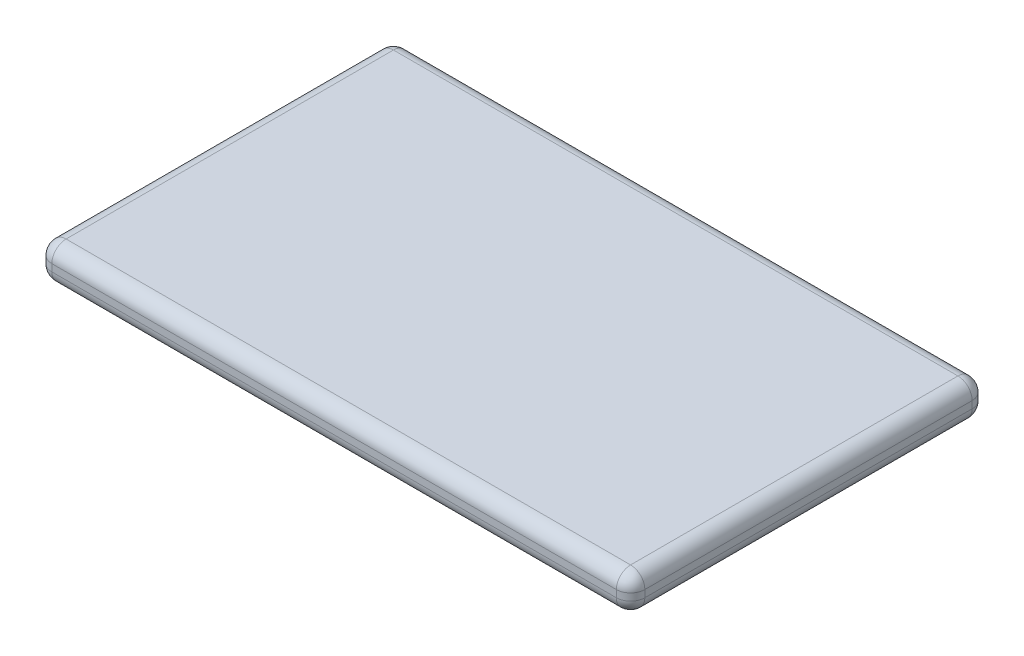
ISO-10303-21;
HEADER;
FILE_DESCRIPTION(('STEP AP214'),'2;1');
FILE_NAME('part.step','',(''),(''),'','','');
FILE_SCHEMA(('AUTOMOTIVE_DESIGN { 1 0 10303 214 1 1 1 1 }'));
ENDSEC;
DATA;
#1=APPLICATION_CONTEXT('core data for automotive mechanical design processes');
#2=APPLICATION_PROTOCOL_DEFINITION('international standard','automotive_design',2000,#1);
#3=PRODUCT_CONTEXT('',#1,'mechanical');
#4=PRODUCT('Part','Part','',(#3));
#5=PRODUCT_RELATED_PRODUCT_CATEGORY('part','',(#4));
#6=PRODUCT_DEFINITION_FORMATION('','',#4);
#7=PRODUCT_DEFINITION_CONTEXT('part definition',#1,'design');
#8=PRODUCT_DEFINITION('design','',#6,#7);
#9=PRODUCT_DEFINITION_SHAPE('','',#8);
#10=(LENGTH_UNIT() NAMED_UNIT(*) SI_UNIT(.MILLI.,.METRE.));
#11=(NAMED_UNIT(*) PLANE_ANGLE_UNIT() SI_UNIT($,.RADIAN.));
#12=(NAMED_UNIT(*) SI_UNIT($,.STERADIAN.) SOLID_ANGLE_UNIT());
#13=UNCERTAINTY_MEASURE_WITH_UNIT(LENGTH_MEASURE(1.E-05),#10,'distance_accuracy_value','');
#14=(GEOMETRIC_REPRESENTATION_CONTEXT(3) GLOBAL_UNCERTAINTY_ASSIGNED_CONTEXT((#13)) GLOBAL_UNIT_ASSIGNED_CONTEXT((#10,
#11,#12)) REPRESENTATION_CONTEXT('',''));
#15=CARTESIAN_POINT('',(0.,0.,0.));
#16=DIRECTION('',(0.,0.,1.));
#17=DIRECTION('',(1.,0.,0.));
#18=AXIS2_PLACEMENT_3D('',#15,#16,#17);
#19=CARTESIAN_POINT('',(-125.,15.,-75.));
#20=DIRECTION('',(0.,0.,-1.));
#21=DIRECTION('',(-1.,0.,0.));
#22=AXIS2_PLACEMENT_3D('',#19,#20,#21);
#23=PLANE('',#22);
#24=DIRECTION('',(1.,0.,0.));
#25=VECTOR('',#24,1.);
#26=CARTESIAN_POINT('',(-125.,6.,-75.));
#27=LINE('',#26,#25);
#28=CARTESIAN_POINT('',(119.,6.,-75.));
#29=VERTEX_POINT('',#28);
#30=CARTESIAN_POINT('',(-119.,6.,-75.));
#31=VERTEX_POINT('',#30);
#32=EDGE_CURVE('E217',#29,#31,#27,.F.);
#33=ORIENTED_EDGE('',*,*,#32,.T.);
#34=DIRECTION('',(0.,-1.,0.));
#35=VECTOR('',#34,1.);
#36=CARTESIAN_POINT('',(-119.,15.,-75.));
#37=LINE('',#36,#35);
#38=CARTESIAN_POINT('',(-119.,9.,-75.));
#39=VERTEX_POINT('',#38);
#40=EDGE_CURVE('E221',#31,#39,#37,.F.);
#41=ORIENTED_EDGE('',*,*,#40,.T.);
#42=DIRECTION('',(1.,0.,0.));
#43=VECTOR('',#42,1.);
#44=CARTESIAN_POINT('',(-125.,9.,-75.));
#45=LINE('',#44,#43);
#46=CARTESIAN_POINT('',(119.,9.,-75.));
#47=VERTEX_POINT('',#46);
#48=EDGE_CURVE('E214',#39,#47,#45,.T.);
#49=ORIENTED_EDGE('',*,*,#48,.T.);
#50=DIRECTION('',(0.,-1.,0.));
#51=VECTOR('',#50,1.);
#52=CARTESIAN_POINT('',(119.,0.,-75.));
#53=LINE('',#52,#51);
#54=EDGE_CURVE('E211',#47,#29,#53,.T.);
#55=ORIENTED_EDGE('',*,*,#54,.T.);
#56=EDGE_LOOP('',(#33,#41,#49,#55));
#57=FACE_BOUND('',#56,.T.);
#58=ADVANCED_FACE('F41',(#57),#23,.T.);
#59=CARTESIAN_POINT('',(-125.,15.,75.));
#60=DIRECTION('',(-1.,0.,0.));
#61=DIRECTION('',(0.,0.,1.));
#62=AXIS2_PLACEMENT_3D('',#59,#60,#61);
#63=PLANE('',#62);
#64=DIRECTION('',(0.,0.,-1.));
#65=VECTOR('',#64,1.);
#66=CARTESIAN_POINT('',(-125.,6.,75.));
#67=LINE('',#66,#65);
#68=CARTESIAN_POINT('',(-125.,6.,-69.));
#69=VERTEX_POINT('',#68);
#70=CARTESIAN_POINT('',(-125.,6.,69.));
#71=VERTEX_POINT('',#70);
#72=EDGE_CURVE('E137',#69,#71,#67,.F.);
#73=ORIENTED_EDGE('',*,*,#72,.T.);
#74=DIRECTION('',(0.,-1.,0.));
#75=VECTOR('',#74,1.);
#76=CARTESIAN_POINT('',(-125.,15.,69.));
#77=LINE('',#76,#75);
#78=CARTESIAN_POINT('',(-125.,9.,69.));
#79=VERTEX_POINT('',#78);
#80=EDGE_CURVE('E182',#71,#79,#77,.F.);
#81=ORIENTED_EDGE('',*,*,#80,.T.);
#82=DIRECTION('',(0.,0.,-1.));
#83=VECTOR('',#82,1.);
#84=CARTESIAN_POINT('',(-125.,9.,75.));
#85=LINE('',#84,#83);
#86=CARTESIAN_POINT('',(-125.,9.,-69.));
#87=VERTEX_POINT('',#86);
#88=EDGE_CURVE('E173',#79,#87,#85,.T.);
#89=ORIENTED_EDGE('',*,*,#88,.T.);
#90=DIRECTION('',(0.,-1.,0.));
#91=VECTOR('',#90,1.);
#92=CARTESIAN_POINT('',(-125.,15.,-69.));
#93=LINE('',#92,#91);
#94=EDGE_CURVE('E169',#87,#69,#93,.T.);
#95=ORIENTED_EDGE('',*,*,#94,.T.);
#96=EDGE_LOOP('',(#73,#81,#89,#95));
#97=FACE_BOUND('',#96,.T.);
#98=ADVANCED_FACE('F362',(#97),#63,.T.);
#99=CARTESIAN_POINT('',(-125.,15.,75.));
#100=DIRECTION('',(0.,0.,-1.));
#101=DIRECTION('',(-1.,0.,0.));
#102=AXIS2_PLACEMENT_3D('',#99,#100,#101);
#103=PLANE('',#102);
#104=DIRECTION('',(1.,0.,0.));
#105=VECTOR('',#104,1.);
#106=CARTESIAN_POINT('',(-125.,9.,75.));
#107=LINE('',#106,#105);
#108=CARTESIAN_POINT('',(119.,9.,75.));
#109=VERTEX_POINT('',#108);
#110=CARTESIAN_POINT('',(-119.,9.,75.));
#111=VERTEX_POINT('',#110);
#112=EDGE_CURVE('E188',#109,#111,#107,.F.);
#113=ORIENTED_EDGE('',*,*,#112,.T.);
#114=DIRECTION('',(0.,-1.,0.));
#115=VECTOR('',#114,1.);
#116=CARTESIAN_POINT('',(-119.,0.,75.));
#117=LINE('',#116,#115);
#118=CARTESIAN_POINT('',(-119.,6.,75.));
#119=VERTEX_POINT('',#118);
#120=EDGE_CURVE('E195',#111,#119,#117,.T.);
#121=ORIENTED_EDGE('',*,*,#120,.T.);
#122=DIRECTION('',(1.,0.,0.));
#123=VECTOR('',#122,1.);
#124=CARTESIAN_POINT('',(-125.,6.,75.));
#125=LINE('',#124,#123);
#126=CARTESIAN_POINT('',(119.,6.,75.));
#127=VERTEX_POINT('',#126);
#128=EDGE_CURVE('E191',#119,#127,#125,.T.);
#129=ORIENTED_EDGE('',*,*,#128,.T.);
#130=DIRECTION('',(0.,-1.,0.));
#131=VECTOR('',#130,1.);
#132=CARTESIAN_POINT('',(119.,15.,75.));
#133=LINE('',#132,#131);
#134=EDGE_CURVE('E185',#127,#109,#133,.F.);
#135=ORIENTED_EDGE('',*,*,#134,.T.);
#136=EDGE_LOOP('',(#113,#121,#129,#135));
#137=FACE_BOUND('',#136,.T.);
#138=ADVANCED_FACE('F325',(#137),#103,.F.);
#139=CARTESIAN_POINT('',(125.,15.,75.));
#140=DIRECTION('',(-1.,0.,0.));
#141=DIRECTION('',(0.,0.,1.));
#142=AXIS2_PLACEMENT_3D('',#139,#140,#141);
#143=PLANE('',#142);
#144=DIRECTION('',(0.,0.,-1.));
#145=VECTOR('',#144,1.);
#146=CARTESIAN_POINT('',(125.,9.,75.));
#147=LINE('',#146,#145);
#148=CARTESIAN_POINT('',(125.,9.,-69.));
#149=VERTEX_POINT('',#148);
#150=CARTESIAN_POINT('',(125.,9.,69.));
#151=VERTEX_POINT('',#150);
#152=EDGE_CURVE('E201',#149,#151,#147,.F.);
#153=ORIENTED_EDGE('',*,*,#152,.T.);
#154=DIRECTION('',(0.,-1.,0.));
#155=VECTOR('',#154,1.);
#156=CARTESIAN_POINT('',(125.,15.,69.));
#157=LINE('',#156,#155);
#158=CARTESIAN_POINT('',(125.,6.,69.));
#159=VERTEX_POINT('',#158);
#160=EDGE_CURVE('E208',#151,#159,#157,.T.);
#161=ORIENTED_EDGE('',*,*,#160,.T.);
#162=DIRECTION('',(0.,0.,-1.));
#163=VECTOR('',#162,1.);
#164=CARTESIAN_POINT('',(125.,6.,75.));
#165=LINE('',#164,#163);
#166=CARTESIAN_POINT('',(125.,6.,-69.));
#167=VERTEX_POINT('',#166);
#168=EDGE_CURVE('E204',#159,#167,#165,.T.);
#169=ORIENTED_EDGE('',*,*,#168,.T.);
#170=DIRECTION('',(0.,-1.,0.));
#171=VECTOR('',#170,1.);
#172=CARTESIAN_POINT('',(125.,15.,-69.));
#173=LINE('',#172,#171);
#174=EDGE_CURVE('E198',#167,#149,#173,.F.);
#175=ORIENTED_EDGE('',*,*,#174,.T.);
#176=EDGE_LOOP('',(#153,#161,#169,#175));
#177=FACE_BOUND('',#176,.T.);
#178=ADVANCED_FACE('F334',(#177),#143,.F.);
#179=CARTESIAN_POINT('',(0.,15.,0.));
#180=DIRECTION('',(0.,1.,0.));
#181=DIRECTION('',(0.,0.,1.));
#182=AXIS2_PLACEMENT_3D('',#179,#180,#181);
#183=PLANE('',#182);
#184=DIRECTION('',(1.,0.,0.));
#185=VECTOR('',#184,1.);
#186=CARTESIAN_POINT('',(125.,15.,69.));
#187=LINE('',#186,#185);
#188=CARTESIAN_POINT('',(-119.,15.,69.));
#189=VERTEX_POINT('',#188);
#190=CARTESIAN_POINT('',(119.,15.,69.));
#191=VERTEX_POINT('',#190);
#192=EDGE_CURVE('E51',#189,#191,#187,.T.);
#193=ORIENTED_EDGE('',*,*,#192,.T.);
#194=DIRECTION('',(0.,0.,-1.));
#195=VECTOR('',#194,1.);
#196=CARTESIAN_POINT('',(119.,15.,-75.));
#197=LINE('',#196,#195);
#198=CARTESIAN_POINT('',(119.,15.,-69.));
#199=VERTEX_POINT('',#198);
#200=EDGE_CURVE('E11',#191,#199,#197,.T.);
#201=ORIENTED_EDGE('',*,*,#200,.T.);
#202=DIRECTION('',(1.,0.,0.));
#203=VECTOR('',#202,1.);
#204=CARTESIAN_POINT('',(0.,15.,-69.));
#205=LINE('',#204,#203);
#206=CARTESIAN_POINT('',(-119.,15.,-69.));
#207=VERTEX_POINT('',#206);
#208=EDGE_CURVE('E224',#199,#207,#205,.F.);
#209=ORIENTED_EDGE('',*,*,#208,.T.);
#210=DIRECTION('',(0.,0.,-1.));
#211=VECTOR('',#210,1.);
#212=CARTESIAN_POINT('',(-119.,15.,0.));
#213=LINE('',#212,#211);
#214=EDGE_CURVE('E62',#207,#189,#213,.F.);
#215=ORIENTED_EDGE('',*,*,#214,.T.);
#216=EDGE_LOOP('',(#193,#201,#209,#215));
#217=FACE_BOUND('',#216,.T.);
#218=ADVANCED_FACE('F346',(#217),#183,.T.);
#219=CARTESIAN_POINT('',(0.,0.,0.));
#220=DIRECTION('',(0.,1.,0.));
#221=DIRECTION('',(0.,0.,1.));
#222=AXIS2_PLACEMENT_3D('',#219,#220,#221);
#223=PLANE('',#222);
#224=DIRECTION('',(1.,0.,0.));
#225=VECTOR('',#224,1.);
#226=CARTESIAN_POINT('',(0.,0.,69.));
#227=LINE('',#226,#225);
#228=CARTESIAN_POINT('',(119.,0.,69.));
#229=VERTEX_POINT('',#228);
#230=CARTESIAN_POINT('',(-119.,0.,69.));
#231=VERTEX_POINT('',#230);
#232=EDGE_CURVE('E166',#229,#231,#227,.F.);
#233=ORIENTED_EDGE('',*,*,#232,.T.);
#234=DIRECTION('',(0.,0.,-1.));
#235=VECTOR('',#234,1.);
#236=CARTESIAN_POINT('',(-119.,0.,-75.));
#237=LINE('',#236,#235);
#238=CARTESIAN_POINT('',(-119.,0.,-69.));
#239=VERTEX_POINT('',#238);
#240=EDGE_CURVE('E135',#231,#239,#237,.T.);
#241=ORIENTED_EDGE('',*,*,#240,.T.);
#242=DIRECTION('',(1.,0.,0.));
#243=VECTOR('',#242,1.);
#244=CARTESIAN_POINT('',(125.,0.,-69.));
#245=LINE('',#244,#243);
#246=CARTESIAN_POINT('',(119.,0.,-69.));
#247=VERTEX_POINT('',#246);
#248=EDGE_CURVE('E155',#239,#247,#245,.T.);
#249=ORIENTED_EDGE('',*,*,#248,.T.);
#250=DIRECTION('',(0.,0.,-1.));
#251=VECTOR('',#250,1.);
#252=CARTESIAN_POINT('',(119.,0.,0.));
#253=LINE('',#252,#251);
#254=EDGE_CURVE('E162',#247,#229,#253,.F.);
#255=ORIENTED_EDGE('',*,*,#254,.T.);
#256=EDGE_LOOP('',(#233,#241,#249,#255));
#257=FACE_BOUND('',#256,.T.);
#258=ADVANCED_FACE('F164',(#257),#223,.F.);
#259=CARTESIAN_POINT('',(119.,9.,0.));
#260=DIRECTION('',(0.,0.,1.));
#261=DIRECTION('',(1.,0.,0.));
#262=AXIS2_PLACEMENT_3D('',#259,#260,#261);
#263=CYLINDRICAL_SURFACE('',#262,6.);
#264=CARTESIAN_POINT('',(119.,9.,69.));
#265=DIRECTION('',(0.,0.,1.));
#266=DIRECTION('',(1.,0.,0.));
#267=AXIS2_PLACEMENT_3D('',#264,#265,#266);
#268=CIRCLE('',#267,6.);
#269=EDGE_CURVE('E45',#151,#191,#268,.T.);
#270=ORIENTED_EDGE('',*,*,#269,.F.);
#271=ORIENTED_EDGE('',*,*,#152,.F.);
#272=CARTESIAN_POINT('',(119.,9.,-69.));
#273=DIRECTION('',(0.,0.,-1.));
#274=DIRECTION('',(-1.,0.,0.));
#275=AXIS2_PLACEMENT_3D('',#272,#273,#274);
#276=CIRCLE('',#275,6.);
#277=EDGE_CURVE('E301',#199,#149,#276,.T.);
#278=ORIENTED_EDGE('',*,*,#277,.F.);
#279=ORIENTED_EDGE('',*,*,#200,.F.);
#280=EDGE_LOOP('',(#270,#271,#278,#279));
#281=FACE_BOUND('',#280,.T.);
#282=ADVANCED_FACE('F43',(#281),#263,.T.);
#283=CARTESIAN_POINT('',(119.,9.,69.));
#284=DIRECTION('',(0.,1.,0.));
#285=DIRECTION('',(0.,0.,1.));
#286=AXIS2_PLACEMENT_3D('',#283,#284,#285);
#287=SPHERICAL_SURFACE('',#286,6.);
#288=CARTESIAN_POINT('',(119.,9.,69.));
#289=DIRECTION('',(0.,1.,0.));
#290=DIRECTION('',(0.,0.,1.));
#291=AXIS2_PLACEMENT_3D('',#288,#289,#290);
#292=CIRCLE('',#291,6.);
#293=EDGE_CURVE('E294',#151,#109,#292,.F.);
#294=ORIENTED_EDGE('',*,*,#293,.F.);
#295=ORIENTED_EDGE('',*,*,#269,.T.);
#296=CARTESIAN_POINT('',(119.,9.,69.));
#297=DIRECTION('',(1.,0.,0.));
#298=DIRECTION('',(0.,0.,-1.));
#299=AXIS2_PLACEMENT_3D('',#296,#297,#298);
#300=CIRCLE('',#299,6.);
#301=EDGE_CURVE('E298',#109,#191,#300,.F.);
#302=ORIENTED_EDGE('',*,*,#301,.F.);
#303=EDGE_LOOP('',(#294,#295,#302));
#304=FACE_BOUND('',#303,.T.);
#305=ADVANCED_FACE('F314',(#304),#287,.T.);
#306=CARTESIAN_POINT('',(119.,9.,-69.));
#307=DIRECTION('',(1.,0.,0.));
#308=DIRECTION('',(0.,0.,-1.));
#309=AXIS2_PLACEMENT_3D('',#306,#307,#308);
#310=SPHERICAL_SURFACE('',#309,6.);
#311=CARTESIAN_POINT('',(119.,9.,-69.));
#312=DIRECTION('',(1.,0.,0.));
#313=DIRECTION('',(0.,0.,-1.));
#314=AXIS2_PLACEMENT_3D('',#311,#312,#313);
#315=CIRCLE('',#314,6.);
#316=EDGE_CURVE('E286',#199,#47,#315,.F.);
#317=ORIENTED_EDGE('',*,*,#316,.F.);
#318=ORIENTED_EDGE('',*,*,#277,.T.);
#319=CARTESIAN_POINT('',(119.,9.,-69.));
#320=DIRECTION('',(0.,1.,0.));
#321=DIRECTION('',(0.,0.,1.));
#322=AXIS2_PLACEMENT_3D('',#319,#320,#321);
#323=CIRCLE('',#322,6.);
#324=EDGE_CURVE('E290',#47,#149,#323,.F.);
#325=ORIENTED_EDGE('',*,*,#324,.F.);
#326=EDGE_LOOP('',(#317,#318,#325));
#327=FACE_BOUND('',#326,.T.);
#328=ADVANCED_FACE('F514',(#327),#310,.T.);
#329=CARTESIAN_POINT('',(0.,9.,69.));
#330=DIRECTION('',(-1.,0.,0.));
#331=DIRECTION('',(0.,0.,1.));
#332=AXIS2_PLACEMENT_3D('',#329,#330,#331);
#333=CYLINDRICAL_SURFACE('',#332,6.);
#334=ORIENTED_EDGE('',*,*,#301,.T.);
#335=ORIENTED_EDGE('',*,*,#192,.F.);
#336=CARTESIAN_POINT('',(-119.,9.,69.));
#337=DIRECTION('',(-1.,0.,0.));
#338=DIRECTION('',(0.,0.,1.));
#339=AXIS2_PLACEMENT_3D('',#336,#337,#338);
#340=CIRCLE('',#339,6.);
#341=EDGE_CURVE('E278',#111,#189,#340,.T.);
#342=ORIENTED_EDGE('',*,*,#341,.F.);
#343=ORIENTED_EDGE('',*,*,#112,.F.);
#344=EDGE_LOOP('',(#334,#335,#342,#343));
#345=FACE_BOUND('',#344,.T.);
#346=ADVANCED_FACE('F320',(#345),#333,.T.);
#347=CARTESIAN_POINT('',(119.,15.,69.));
#348=DIRECTION('',(0.,-1.,0.));
#349=DIRECTION('',(0.,0.,-1.));
#350=AXIS2_PLACEMENT_3D('',#347,#348,#349);
#351=CYLINDRICAL_SURFACE('',#350,6.);
#352=ORIENTED_EDGE('',*,*,#293,.T.);
#353=ORIENTED_EDGE('',*,*,#134,.F.);
#354=CARTESIAN_POINT('',(119.,6.,69.));
#355=DIRECTION('',(0.,-1.,0.));
#356=DIRECTION('',(0.,0.,-1.));
#357=AXIS2_PLACEMENT_3D('',#354,#355,#356);
#358=CIRCLE('',#357,6.);
#359=EDGE_CURVE('E274',#159,#127,#358,.T.);
#360=ORIENTED_EDGE('',*,*,#359,.F.);
#361=ORIENTED_EDGE('',*,*,#160,.F.);
#362=EDGE_LOOP('',(#352,#353,#360,#361));
#363=FACE_BOUND('',#362,.T.);
#364=ADVANCED_FACE('F331',(#363),#351,.T.);
#365=CARTESIAN_POINT('',(119.,6.,75.));
#366=DIRECTION('',(0.,0.,-1.));
#367=DIRECTION('',(-1.,0.,0.));
#368=AXIS2_PLACEMENT_3D('',#365,#366,#367);
#369=CYLINDRICAL_SURFACE('',#368,6.);
#370=CARTESIAN_POINT('',(119.,6.,-69.));
#371=DIRECTION('',(0.,0.,-1.));
#372=DIRECTION('',(-1.,0.,0.));
#373=AXIS2_PLACEMENT_3D('',#370,#371,#372);
#374=CIRCLE('',#373,6.);
#375=EDGE_CURVE('E266',#167,#247,#374,.T.);
#376=ORIENTED_EDGE('',*,*,#375,.F.);
#377=ORIENTED_EDGE('',*,*,#168,.F.);
#378=CARTESIAN_POINT('',(119.,6.,69.));
#379=DIRECTION('',(0.,0.,1.));
#380=DIRECTION('',(1.,0.,0.));
#381=AXIS2_PLACEMENT_3D('',#378,#379,#380);
#382=CIRCLE('',#381,6.);
#383=EDGE_CURVE('E270',#229,#159,#382,.T.);
#384=ORIENTED_EDGE('',*,*,#383,.F.);
#385=ORIENTED_EDGE('',*,*,#254,.F.);
#386=EDGE_LOOP('',(#376,#377,#384,#385));
#387=FACE_BOUND('',#386,.T.);
#388=ADVANCED_FACE('F338',(#387),#369,.T.);
#389=CARTESIAN_POINT('',(119.,15.,-69.));
#390=DIRECTION('',(0.,1.,0.));
#391=DIRECTION('',(0.,0.,1.));
#392=AXIS2_PLACEMENT_3D('',#389,#390,#391);
#393=CYLINDRICAL_SURFACE('',#392,6.);
#394=ORIENTED_EDGE('',*,*,#324,.T.);
#395=ORIENTED_EDGE('',*,*,#174,.F.);
#396=CARTESIAN_POINT('',(119.,6.,-69.));
#397=DIRECTION('',(0.,-1.,0.));
#398=DIRECTION('',(0.,0.,-1.));
#399=AXIS2_PLACEMENT_3D('',#396,#397,#398);
#400=CIRCLE('',#399,6.);
#401=EDGE_CURVE('E263',#29,#167,#400,.T.);
#402=ORIENTED_EDGE('',*,*,#401,.F.);
#403=ORIENTED_EDGE('',*,*,#54,.F.);
#404=EDGE_LOOP('',(#394,#395,#402,#403));
#405=FACE_BOUND('',#404,.T.);
#406=ADVANCED_FACE('F344',(#405),#393,.T.);
#407=CARTESIAN_POINT('',(-125.,9.,-69.));
#408=DIRECTION('',(1.,0.,0.));
#409=DIRECTION('',(0.,0.,-1.));
#410=AXIS2_PLACEMENT_3D('',#407,#408,#409);
#411=CYLINDRICAL_SURFACE('',#410,6.);
#412=ORIENTED_EDGE('',*,*,#316,.T.);
#413=ORIENTED_EDGE('',*,*,#48,.F.);
#414=CARTESIAN_POINT('',(-119.,9.,-69.));
#415=DIRECTION('',(-1.,0.,0.));
#416=DIRECTION('',(0.,0.,1.));
#417=AXIS2_PLACEMENT_3D('',#414,#415,#416);
#418=CIRCLE('',#417,6.);
#419=EDGE_CURVE('E259',#207,#39,#418,.T.);
#420=ORIENTED_EDGE('',*,*,#419,.F.);
#421=ORIENTED_EDGE('',*,*,#208,.F.);
#422=EDGE_LOOP('',(#412,#413,#420,#421));
#423=FACE_BOUND('',#422,.T.);
#424=ADVANCED_FACE('F355',(#423),#411,.T.);
#425=CARTESIAN_POINT('',(-119.,9.,75.));
#426=DIRECTION('',(0.,0.,-1.));
#427=DIRECTION('',(-1.,0.,0.));
#428=AXIS2_PLACEMENT_3D('',#425,#426,#427);
#429=CYLINDRICAL_SURFACE('',#428,6.);
#430=CARTESIAN_POINT('',(-119.,9.,69.));
#431=DIRECTION('',(0.,0.,1.));
#432=DIRECTION('',(1.,0.,0.));
#433=AXIS2_PLACEMENT_3D('',#430,#431,#432);
#434=CIRCLE('',#433,6.);
#435=EDGE_CURVE('E282',#189,#79,#434,.T.);
#436=ORIENTED_EDGE('',*,*,#435,.F.);
#437=ORIENTED_EDGE('',*,*,#214,.F.);
#438=CARTESIAN_POINT('',(-119.,9.,-69.));
#439=DIRECTION('',(0.,0.,-1.));
#440=DIRECTION('',(0.,1.,0.));
#441=AXIS2_PLACEMENT_3D('',#438,#439,#440);
#442=CIRCLE('',#441,6.);
#443=EDGE_CURVE('E255',#87,#207,#442,.T.);
#444=ORIENTED_EDGE('',*,*,#443,.F.);
#445=ORIENTED_EDGE('',*,*,#88,.F.);
#446=EDGE_LOOP('',(#436,#437,#444,#445));
#447=FACE_BOUND('',#446,.T.);
#448=ADVANCED_FACE('F351',(#447),#429,.T.);
#449=CARTESIAN_POINT('',(-119.,9.,69.));
#450=DIRECTION('',(0.,1.,0.));
#451=DIRECTION('',(0.,0.,1.));
#452=AXIS2_PLACEMENT_3D('',#449,#450,#451);
#453=SPHERICAL_SURFACE('',#452,6.);
#454=ORIENTED_EDGE('',*,*,#341,.T.);
#455=ORIENTED_EDGE('',*,*,#435,.T.);
#456=CARTESIAN_POINT('',(-119.,9.,69.));
#457=DIRECTION('',(0.,1.,0.));
#458=DIRECTION('',(0.,0.,1.));
#459=AXIS2_PLACEMENT_3D('',#456,#457,#458);
#460=CIRCLE('',#459,6.);
#461=EDGE_CURVE('E251',#111,#79,#460,.F.);
#462=ORIENTED_EDGE('',*,*,#461,.F.);
#463=EDGE_LOOP('',(#454,#455,#462));
#464=FACE_BOUND('',#463,.T.);
#465=ADVANCED_FACE('F365',(#464),#453,.T.);
#466=CARTESIAN_POINT('',(119.,6.,69.));
#467=DIRECTION('',(1.,0.,0.));
#468=DIRECTION('',(0.,0.,-1.));
#469=AXIS2_PLACEMENT_3D('',#466,#467,#468);
#470=SPHERICAL_SURFACE('',#469,6.);
#471=ORIENTED_EDGE('',*,*,#383,.T.);
#472=ORIENTED_EDGE('',*,*,#359,.T.);
#473=CARTESIAN_POINT('',(119.,6.,69.));
#474=DIRECTION('',(1.,0.,0.));
#475=DIRECTION('',(0.,0.,-1.));
#476=AXIS2_PLACEMENT_3D('',#473,#474,#475);
#477=CIRCLE('',#476,6.);
#478=EDGE_CURVE('E248',#229,#127,#477,.F.);
#479=ORIENTED_EDGE('',*,*,#478,.F.);
#480=EDGE_LOOP('',(#471,#472,#479));
#481=FACE_BOUND('',#480,.T.);
#482=ADVANCED_FACE('F375',(#481),#470,.T.);
#483=CARTESIAN_POINT('',(119.,6.,-69.));
#484=DIRECTION('',(1.,0.,0.));
#485=DIRECTION('',(0.,0.,-1.));
#486=AXIS2_PLACEMENT_3D('',#483,#484,#485);
#487=SPHERICAL_SURFACE('',#486,6.);
#488=ORIENTED_EDGE('',*,*,#401,.T.);
#489=ORIENTED_EDGE('',*,*,#375,.T.);
#490=CARTESIAN_POINT('',(119.,6.,-69.));
#491=DIRECTION('',(1.,0.,0.));
#492=DIRECTION('',(0.,0.,-1.));
#493=AXIS2_PLACEMENT_3D('',#490,#491,#492);
#494=CIRCLE('',#493,6.);
#495=EDGE_CURVE('E158',#29,#247,#494,.F.);
#496=ORIENTED_EDGE('',*,*,#495,.F.);
#497=EDGE_LOOP('',(#488,#489,#496));
#498=FACE_BOUND('',#497,.T.);
#499=ADVANCED_FACE('F377',(#498),#487,.T.);
#500=CARTESIAN_POINT('',(-119.,9.,-69.));
#501=DIRECTION('',(0.,1.,0.));
#502=DIRECTION('',(0.,0.,1.));
#503=AXIS2_PLACEMENT_3D('',#500,#501,#502);
#504=SPHERICAL_SURFACE('',#503,6.);
#505=ORIENTED_EDGE('',*,*,#443,.T.);
#506=ORIENTED_EDGE('',*,*,#419,.T.);
#507=CARTESIAN_POINT('',(-119.,9.,-69.));
#508=DIRECTION('',(0.,1.,0.));
#509=DIRECTION('',(0.,0.,1.));
#510=AXIS2_PLACEMENT_3D('',#507,#508,#509);
#511=CIRCLE('',#510,6.);
#512=EDGE_CURVE('E242',#87,#39,#511,.F.);
#513=ORIENTED_EDGE('',*,*,#512,.F.);
#514=EDGE_LOOP('',(#505,#506,#513));
#515=FACE_BOUND('',#514,.T.);
#516=ADVANCED_FACE('F357',(#515),#504,.T.);
#517=CARTESIAN_POINT('',(-119.,15.,69.));
#518=DIRECTION('',(0.,1.,0.));
#519=DIRECTION('',(0.,0.,1.));
#520=AXIS2_PLACEMENT_3D('',#517,#518,#519);
#521=CYLINDRICAL_SURFACE('',#520,6.);
#522=ORIENTED_EDGE('',*,*,#461,.T.);
#523=ORIENTED_EDGE('',*,*,#80,.F.);
#524=CARTESIAN_POINT('',(-119.,6.,69.));
#525=DIRECTION('',(0.,-1.,0.));
#526=DIRECTION('',(0.,0.,-1.));
#527=AXIS2_PLACEMENT_3D('',#524,#525,#526);
#528=CIRCLE('',#527,6.);
#529=EDGE_CURVE('E238',#119,#71,#528,.T.);
#530=ORIENTED_EDGE('',*,*,#529,.F.);
#531=ORIENTED_EDGE('',*,*,#120,.F.);
#532=EDGE_LOOP('',(#522,#523,#530,#531));
#533=FACE_BOUND('',#532,.T.);
#534=ADVANCED_FACE('F367',(#533),#521,.T.);
#535=CARTESIAN_POINT('',(-125.,6.,69.));
#536=DIRECTION('',(1.,0.,0.));
#537=DIRECTION('',(0.,0.,-1.));
#538=AXIS2_PLACEMENT_3D('',#535,#536,#537);
#539=CYLINDRICAL_SURFACE('',#538,6.);
#540=ORIENTED_EDGE('',*,*,#478,.T.);
#541=ORIENTED_EDGE('',*,*,#128,.F.);
#542=CARTESIAN_POINT('',(-119.,6.,69.));
#543=DIRECTION('',(-1.,0.,0.));
#544=DIRECTION('',(0.,0.,1.));
#545=AXIS2_PLACEMENT_3D('',#542,#543,#544);
#546=CIRCLE('',#545,6.);
#547=EDGE_CURVE('E152',#231,#119,#546,.T.);
#548=ORIENTED_EDGE('',*,*,#547,.F.);
#549=ORIENTED_EDGE('',*,*,#232,.F.);
#550=EDGE_LOOP('',(#540,#541,#548,#549));
#551=FACE_BOUND('',#550,.T.);
#552=ADVANCED_FACE('F373',(#551),#539,.T.);
#553=CARTESIAN_POINT('',(0.,6.,-69.));
#554=DIRECTION('',(-1.,0.,0.));
#555=DIRECTION('',(0.,0.,1.));
#556=AXIS2_PLACEMENT_3D('',#553,#554,#555);
#557=CYLINDRICAL_SURFACE('',#556,6.);
#558=ORIENTED_EDGE('',*,*,#495,.T.);
#559=ORIENTED_EDGE('',*,*,#248,.F.);
#560=CARTESIAN_POINT('',(-119.,6.,-69.));
#561=DIRECTION('',(-1.,0.,0.));
#562=DIRECTION('',(0.,0.,1.));
#563=AXIS2_PLACEMENT_3D('',#560,#561,#562);
#564=CIRCLE('',#563,6.);
#565=EDGE_CURVE('E143',#31,#239,#564,.T.);
#566=ORIENTED_EDGE('',*,*,#565,.F.);
#567=ORIENTED_EDGE('',*,*,#32,.F.);
#568=EDGE_LOOP('',(#558,#559,#566,#567));
#569=FACE_BOUND('',#568,.T.);
#570=ADVANCED_FACE('F156',(#569),#557,.T.);
#571=CARTESIAN_POINT('',(-119.,15.,-69.));
#572=DIRECTION('',(0.,-1.,0.));
#573=DIRECTION('',(0.,0.,-1.));
#574=AXIS2_PLACEMENT_3D('',#571,#572,#573);
#575=CYLINDRICAL_SURFACE('',#574,6.);
#576=ORIENTED_EDGE('',*,*,#512,.T.);
#577=ORIENTED_EDGE('',*,*,#40,.F.);
#578=CARTESIAN_POINT('',(-119.,6.,-69.));
#579=DIRECTION('',(0.,-1.,0.));
#580=DIRECTION('',(0.,0.,-1.));
#581=AXIS2_PLACEMENT_3D('',#578,#579,#580);
#582=CIRCLE('',#581,6.);
#583=EDGE_CURVE('E147',#69,#31,#582,.T.);
#584=ORIENTED_EDGE('',*,*,#583,.F.);
#585=ORIENTED_EDGE('',*,*,#94,.F.);
#586=EDGE_LOOP('',(#576,#577,#584,#585));
#587=FACE_BOUND('',#586,.T.);
#588=ADVANCED_FACE('F360',(#587),#575,.T.);
#589=CARTESIAN_POINT('',(-119.,6.,69.));
#590=DIRECTION('',(0.,0.,1.));
#591=DIRECTION('',(1.,0.,0.));
#592=AXIS2_PLACEMENT_3D('',#589,#590,#591);
#593=SPHERICAL_SURFACE('',#592,6.);
#594=ORIENTED_EDGE('',*,*,#547,.T.);
#595=ORIENTED_EDGE('',*,*,#529,.T.);
#596=CARTESIAN_POINT('',(-119.,6.,69.));
#597=DIRECTION('',(0.,0.,1.));
#598=DIRECTION('',(1.,0.,0.));
#599=AXIS2_PLACEMENT_3D('',#596,#597,#598);
#600=CIRCLE('',#599,6.);
#601=EDGE_CURVE('E140',#231,#71,#600,.F.);
#602=ORIENTED_EDGE('',*,*,#601,.F.);
#603=EDGE_LOOP('',(#594,#595,#602));
#604=FACE_BOUND('',#603,.T.);
#605=ADVANCED_FACE('F371',(#604),#593,.T.);
#606=CARTESIAN_POINT('',(-119.,6.,-69.));
#607=DIRECTION('',(0.,0.,-1.));
#608=DIRECTION('',(-1.,0.,0.));
#609=AXIS2_PLACEMENT_3D('',#606,#607,#608);
#610=SPHERICAL_SURFACE('',#609,6.);
#611=ORIENTED_EDGE('',*,*,#583,.T.);
#612=ORIENTED_EDGE('',*,*,#565,.T.);
#613=CARTESIAN_POINT('',(-119.,6.,-69.));
#614=DIRECTION('',(0.,0.,-1.));
#615=DIRECTION('',(-1.,0.,0.));
#616=AXIS2_PLACEMENT_3D('',#613,#614,#615);
#617=CIRCLE('',#616,6.);
#618=EDGE_CURVE('E131',#69,#239,#617,.F.);
#619=ORIENTED_EDGE('',*,*,#618,.F.);
#620=EDGE_LOOP('',(#611,#612,#619));
#621=FACE_BOUND('',#620,.T.);
#622=ADVANCED_FACE('F145',(#621),#610,.T.);
#623=CARTESIAN_POINT('',(-119.,6.,0.));
#624=DIRECTION('',(0.,0.,1.));
#625=DIRECTION('',(1.,0.,0.));
#626=AXIS2_PLACEMENT_3D('',#623,#624,#625);
#627=CYLINDRICAL_SURFACE('',#626,6.);
#628=ORIENTED_EDGE('',*,*,#601,.T.);
#629=ORIENTED_EDGE('',*,*,#72,.F.);
#630=ORIENTED_EDGE('',*,*,#618,.T.);
#631=ORIENTED_EDGE('',*,*,#240,.F.);
#632=EDGE_LOOP('',(#628,#629,#630,#631));
#633=FACE_BOUND('',#632,.T.);
#634=ADVANCED_FACE('F133',(#633),#627,.T.);
#635=CLOSED_SHELL('',(#58,#98,#138,#178,#218,#258,#282,#305,#328,#346,#364,#388,#406,#424,#448,
#465,#482,#499,#516,#534,#552,#570,#588,#605,#622,#634));
#636=MANIFOLD_SOLID_BREP('B2',#635);
#637=ADVANCED_BREP_SHAPE_REPRESENTATION('',(#18,#636),#14);
#638=SHAPE_DEFINITION_REPRESENTATION(#9,#637);
ENDSEC;
END-ISO-10303-21;
